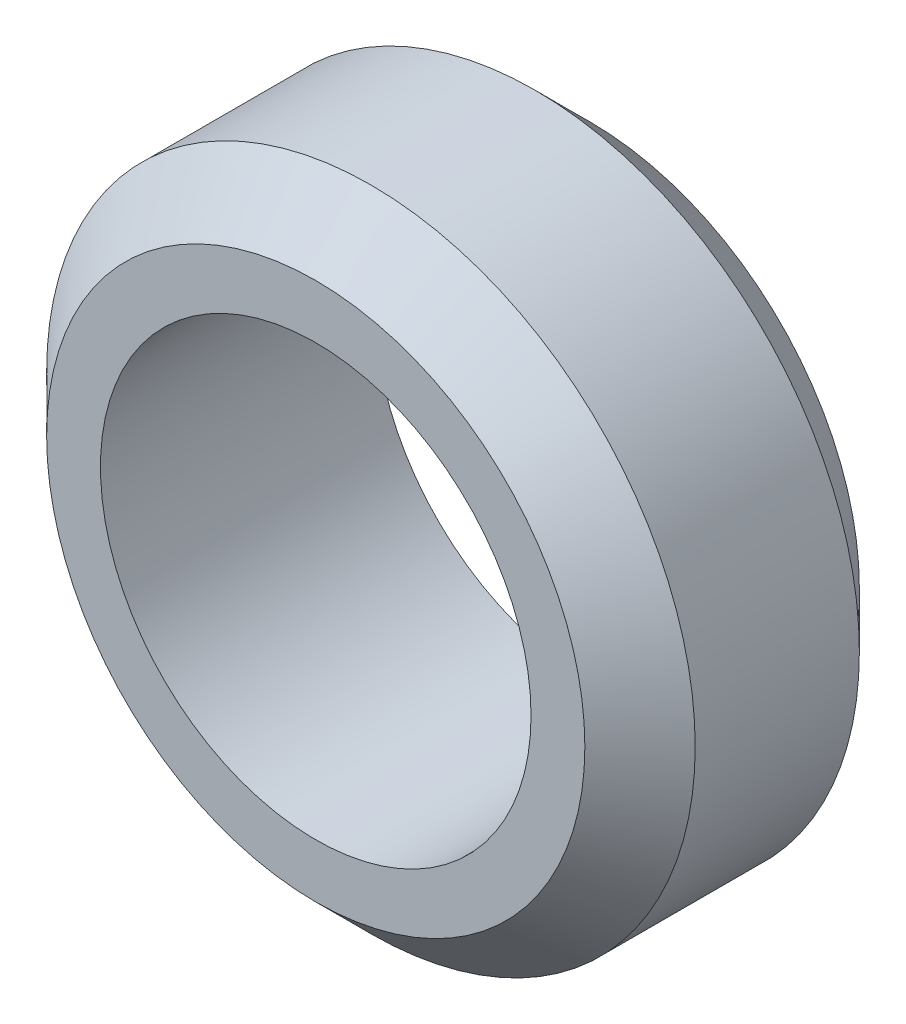
ISO-10303-21;
HEADER;
FILE_DESCRIPTION(('STEP AP214'),'2;1');
FILE_NAME('part.step','',(''),(''),'','','');
FILE_SCHEMA(('AUTOMOTIVE_DESIGN { 1 0 10303 214 1 1 1 1 }'));
ENDSEC;
DATA;
#1=APPLICATION_CONTEXT('core data for automotive mechanical design processes');
#2=APPLICATION_PROTOCOL_DEFINITION('international standard','automotive_design',2000,#1);
#3=PRODUCT_CONTEXT('',#1,'mechanical');
#4=PRODUCT('Part','Part','',(#3));
#5=PRODUCT_RELATED_PRODUCT_CATEGORY('part','',(#4));
#6=PRODUCT_DEFINITION_FORMATION('','',#4);
#7=PRODUCT_DEFINITION_CONTEXT('part definition',#1,'design');
#8=PRODUCT_DEFINITION('design','',#6,#7);
#9=PRODUCT_DEFINITION_SHAPE('','',#8);
#10=(LENGTH_UNIT() NAMED_UNIT(*) SI_UNIT(.MILLI.,.METRE.));
#11=(NAMED_UNIT(*) PLANE_ANGLE_UNIT() SI_UNIT($,.RADIAN.));
#12=(NAMED_UNIT(*) SI_UNIT($,.STERADIAN.) SOLID_ANGLE_UNIT());
#13=UNCERTAINTY_MEASURE_WITH_UNIT(LENGTH_MEASURE(1.E-05),#10,'distance_accuracy_value','');
#14=(GEOMETRIC_REPRESENTATION_CONTEXT(3) GLOBAL_UNCERTAINTY_ASSIGNED_CONTEXT((#13)) GLOBAL_UNIT_ASSIGNED_CONTEXT((#10,
#11,#12)) REPRESENTATION_CONTEXT('',''));
#15=CARTESIAN_POINT('',(0.,0.,0.));
#16=DIRECTION('',(0.,0.,1.));
#17=DIRECTION('',(1.,0.,0.));
#18=AXIS2_PLACEMENT_3D('',#15,#16,#17);
#19=CARTESIAN_POINT('',(0.,0.,5.1));
#20=DIRECTION('',(0.,0.,1.));
#21=DIRECTION('',(1.,0.,0.));
#22=AXIS2_PLACEMENT_3D('',#19,#20,#21);
#23=PLANE('',#22);
#24=CARTESIAN_POINT('',(0.,0.,5.1));
#25=DIRECTION('',(0.,0.,1.));
#26=DIRECTION('',(1.,0.,0.));
#27=AXIS2_PLACEMENT_3D('',#24,#25,#26);
#28=CIRCLE('',#27,9.99999999999999);
#29=CARTESIAN_POINT('',(9.99999999999999,0.,5.1));
#30=VERTEX_POINT('',#29);
#31=EDGE_CURVE('E12',#30,#30,#28,.T.);
#32=ORIENTED_EDGE('',*,*,#31,.T.);
#33=EDGE_LOOP('',(#32));
#34=FACE_BOUND('',#33,.T.);
#35=CARTESIAN_POINT('',(0.,0.,5.1));
#36=DIRECTION('',(0.,0.,1.));
#37=DIRECTION('',(1.,0.,0.));
#38=AXIS2_PLACEMENT_3D('',#35,#36,#37);
#39=CIRCLE('',#38,8.);
#40=CARTESIAN_POINT('',(8.,0.,5.1));
#41=VERTEX_POINT('',#40);
#42=EDGE_CURVE('E79',#41,#41,#39,.T.);
#43=ORIENTED_EDGE('',*,*,#42,.F.);
#44=EDGE_LOOP('',(#43));
#45=FACE_BOUND('',#44,.T.);
#46=ADVANCED_FACE('F52',(#34,#45),#23,.T.);
#47=CARTESIAN_POINT('',(0.,0.,-5.1));
#48=DIRECTION('',(0.,0.,1.));
#49=DIRECTION('',(1.,0.,0.));
#50=AXIS2_PLACEMENT_3D('',#47,#48,#49);
#51=PLANE('',#50);
#52=CARTESIAN_POINT('',(0.,0.,-5.1));
#53=DIRECTION('',(0.,0.,1.));
#54=DIRECTION('',(1.,0.,0.));
#55=AXIS2_PLACEMENT_3D('',#52,#53,#54);
#56=CIRCLE('',#55,9.99999999999999);
#57=CARTESIAN_POINT('',(9.99999999999999,0.,-5.1));
#58=VERTEX_POINT('',#57);
#59=EDGE_CURVE('E61',#58,#58,#56,.F.);
#60=ORIENTED_EDGE('',*,*,#59,.T.);
#61=EDGE_LOOP('',(#60));
#62=FACE_BOUND('',#61,.T.);
#63=CARTESIAN_POINT('',(0.,0.,-5.1));
#64=DIRECTION('',(0.,0.,1.));
#65=DIRECTION('',(1.,0.,0.));
#66=AXIS2_PLACEMENT_3D('',#63,#64,#65);
#67=CIRCLE('',#66,8.);
#68=CARTESIAN_POINT('',(8.,0.,-5.1));
#69=VERTEX_POINT('',#68);
#70=EDGE_CURVE('E80',#69,#69,#67,.T.);
#71=ORIENTED_EDGE('',*,*,#70,.T.);
#72=EDGE_LOOP('',(#71));
#73=FACE_BOUND('',#72,.T.);
#74=ADVANCED_FACE('F90',(#62,#73),#51,.F.);
#75=CARTESIAN_POINT('',(0.,0.,5.1));
#76=DIRECTION('',(0.,0.,-1.));
#77=DIRECTION('',(-1.,0.,0.));
#78=AXIS2_PLACEMENT_3D('',#75,#76,#77);
#79=CYLINDRICAL_SURFACE('',#78,12.05);
#80=CARTESIAN_POINT('',(0.,0.,-3.04999999999999));
#81=DIRECTION('',(0.,0.,1.));
#82=DIRECTION('',(1.,0.,0.));
#83=AXIS2_PLACEMENT_3D('',#80,#81,#82);
#84=CIRCLE('',#83,12.05);
#85=CARTESIAN_POINT('',(12.05,0.,-3.04999999999999));
#86=VERTEX_POINT('',#85);
#87=EDGE_CURVE('E68',#86,#86,#84,.T.);
#88=ORIENTED_EDGE('',*,*,#87,.T.);
#89=EDGE_LOOP('',(#88));
#90=FACE_BOUND('',#89,.T.);
#91=CARTESIAN_POINT('',(0.,0.,3.04999999999999));
#92=DIRECTION('',(0.,0.,1.));
#93=DIRECTION('',(1.,0.,0.));
#94=AXIS2_PLACEMENT_3D('',#91,#92,#93);
#95=CIRCLE('',#94,12.05);
#96=CARTESIAN_POINT('',(12.05,0.,3.04999999999999));
#97=VERTEX_POINT('',#96);
#98=EDGE_CURVE('E74',#97,#97,#95,.F.);
#99=ORIENTED_EDGE('',*,*,#98,.T.);
#100=EDGE_LOOP('',(#99));
#101=FACE_BOUND('',#100,.T.);
#102=ADVANCED_FACE('F95',(#90,#101),#79,.T.);
#103=CARTESIAN_POINT('',(0.,0.,5.1));
#104=DIRECTION('',(0.,0.,-1.));
#105=DIRECTION('',(-1.,0.,0.));
#106=AXIS2_PLACEMENT_3D('',#103,#104,#105);
#107=CYLINDRICAL_SURFACE('',#106,8.);
#108=ORIENTED_EDGE('',*,*,#42,.T.);
#109=EDGE_LOOP('',(#108));
#110=FACE_BOUND('',#109,.T.);
#111=ORIENTED_EDGE('',*,*,#70,.F.);
#112=EDGE_LOOP('',(#111));
#113=FACE_BOUND('',#112,.T.);
#114=ADVANCED_FACE('F86',(#110,#113),#107,.F.);
#115=CARTESIAN_POINT('',(0.,0.,-3.04999999999999));
#116=DIRECTION('',(0.,0.,1.));
#117=DIRECTION('',(1.,0.,0.));
#118=AXIS2_PLACEMENT_3D('',#115,#116,#117);
#119=CONICAL_SURFACE('',#118,12.05,0.78539816339745);
#120=ORIENTED_EDGE('',*,*,#59,.F.);
#121=EDGE_LOOP('',(#120));
#122=FACE_BOUND('',#121,.T.);
#123=ORIENTED_EDGE('',*,*,#87,.F.);
#124=EDGE_LOOP('',(#123));
#125=FACE_BOUND('',#124,.T.);
#126=ADVANCED_FACE('F102',(#122,#125),#119,.T.);
#127=CARTESIAN_POINT('',(0.,0.,5.1));
#128=DIRECTION('',(0.,0.,-1.));
#129=DIRECTION('',(-1.,0.,0.));
#130=AXIS2_PLACEMENT_3D('',#127,#128,#129);
#131=CONICAL_SURFACE('',#130,9.99999999999999,0.785398163397447);
#132=ORIENTED_EDGE('',*,*,#98,.F.);
#133=EDGE_LOOP('',(#132));
#134=FACE_BOUND('',#133,.T.);
#135=ORIENTED_EDGE('',*,*,#31,.F.);
#136=EDGE_LOOP('',(#135));
#137=FACE_BOUND('',#136,.T.);
#138=ADVANCED_FACE('F55',(#134,#137),#131,.T.);
#139=CLOSED_SHELL('',(#46,#74,#102,#114,#126,#138));
#140=MANIFOLD_SOLID_BREP('B2',#139);
#141=ADVANCED_BREP_SHAPE_REPRESENTATION('',(#18,#140),#14);
#142=SHAPE_DEFINITION_REPRESENTATION(#9,#141);
ENDSEC;
END-ISO-10303-21;
